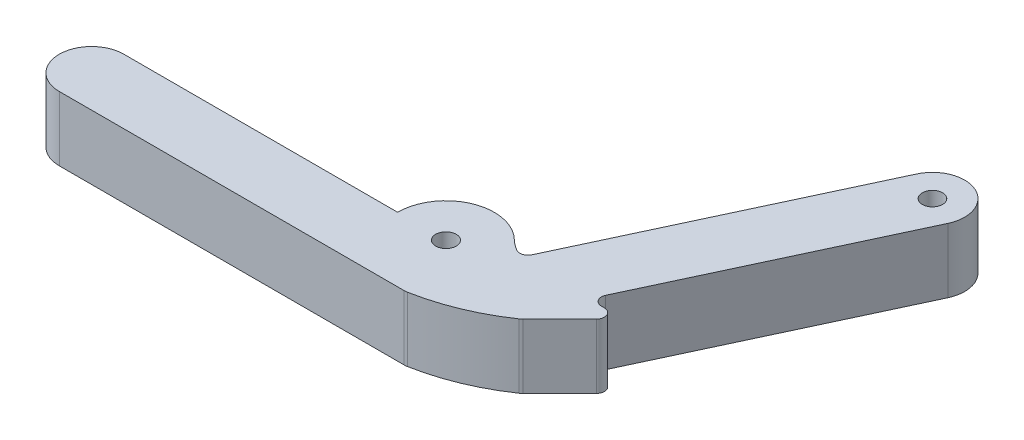
ISO-10303-21;
HEADER;
FILE_DESCRIPTION(('STEP AP214'),'2;1');
FILE_NAME('part.step','',(''),(''),'','','');
FILE_SCHEMA(('AUTOMOTIVE_DESIGN { 1 0 10303 214 1 1 1 1 }'));
ENDSEC;
DATA;
#1=APPLICATION_CONTEXT('core data for automotive mechanical design processes');
#2=APPLICATION_PROTOCOL_DEFINITION('international standard','automotive_design',2000,#1);
#3=PRODUCT_CONTEXT('',#1,'mechanical');
#4=PRODUCT('Part','Part','',(#3));
#5=PRODUCT_RELATED_PRODUCT_CATEGORY('part','',(#4));
#6=PRODUCT_DEFINITION_FORMATION('','',#4);
#7=PRODUCT_DEFINITION_CONTEXT('part definition',#1,'design');
#8=PRODUCT_DEFINITION('design','',#6,#7);
#9=PRODUCT_DEFINITION_SHAPE('','',#8);
#10=(LENGTH_UNIT() NAMED_UNIT(*) SI_UNIT(.MILLI.,.METRE.));
#11=(NAMED_UNIT(*) PLANE_ANGLE_UNIT() SI_UNIT($,.RADIAN.));
#12=(NAMED_UNIT(*) SI_UNIT($,.STERADIAN.) SOLID_ANGLE_UNIT());
#13=UNCERTAINTY_MEASURE_WITH_UNIT(LENGTH_MEASURE(1.E-05),#10,'distance_accuracy_value','');
#14=(GEOMETRIC_REPRESENTATION_CONTEXT(3) GLOBAL_UNCERTAINTY_ASSIGNED_CONTEXT((#13)) GLOBAL_UNIT_ASSIGNED_CONTEXT((#10,
#11,#12)) REPRESENTATION_CONTEXT('',''));
#15=CARTESIAN_POINT('',(0.,0.,0.));
#16=DIRECTION('',(0.,0.,1.));
#17=DIRECTION('',(1.,0.,0.));
#18=AXIS2_PLACEMENT_3D('',#15,#16,#17);
#19=CARTESIAN_POINT('',(-72.8411258837622,25.4,-62.4234738956629));
#20=DIRECTION('',(0.,1.,0.));
#21=DIRECTION('',(0.,0.,1.));
#22=AXIS2_PLACEMENT_3D('',#19,#20,#21);
#23=PLANE('',#22);
#24=CARTESIAN_POINT('',(54.1588741162378,25.4,-75.150873895024));
#25=DIRECTION('',(0.,1.,0.));
#26=DIRECTION('',(0.,0.,1.));
#27=AXIS2_PLACEMENT_3D('',#24,#25,#26);
#28=CIRCLE('',#27,4.05);
#29=CARTESIAN_POINT('',(54.1588741162378,25.4,-71.100873895024));
#30=VERTEX_POINT('',#29);
#31=EDGE_CURVE('E223',#30,#30,#28,.T.);
#32=ORIENTED_EDGE('',*,*,#31,.F.);
#33=EDGE_LOOP('',(#32));
#34=FACE_BOUND('',#33,.T.);
#35=CARTESIAN_POINT('',(-72.8411258837622,25.4,-62.4234738956629));
#36=DIRECTION('',(0.,1.,0.));
#37=DIRECTION('',(0.,0.,1.));
#38=AXIS2_PLACEMENT_3D('',#35,#36,#37);
#39=CIRCLE('',#38,12.7273999993611);
#40=CARTESIAN_POINT('',(-72.8411258837622,25.4,-75.150873895024));
#41=VERTEX_POINT('',#40);
#42=CARTESIAN_POINT('',(-72.8411258837622,25.4,-49.6960738963018));
#43=VERTEX_POINT('',#42);
#44=EDGE_CURVE('E265',#41,#43,#39,.T.);
#45=ORIENTED_EDGE('',*,*,#44,.T.);
#46=DIRECTION('',(1.,0.,0.));
#47=VECTOR('',#46,1.);
#48=CARTESIAN_POINT('',(-72.8411258837622,25.4,-49.6960738963018));
#49=LINE('',#48,#47);
#50=CARTESIAN_POINT('',(63.1581007165939,25.4,-49.6960738963018));
#51=VERTEX_POINT('',#50);
#52=EDGE_CURVE('E143',#43,#51,#49,.T.);
#53=ORIENTED_EDGE('',*,*,#52,.T.);
#54=CARTESIAN_POINT('',(63.1581007165939,25.4,-56.0460738963018));
#55=DIRECTION('',(0.,1.,0.));
#56=DIRECTION('',(0.,0.,-1.));
#57=AXIS2_PLACEMENT_3D('',#54,#55,#56);
#58=CIRCLE('',#57,6.34999999999999);
#59=CARTESIAN_POINT('',(64.3217055284206,25.4,-49.8035965161351));
#60=VERTEX_POINT('',#59);
#61=EDGE_CURVE('E318',#51,#60,#58,.T.);
#62=ORIENTED_EDGE('',*,*,#61,.T.);
#63=CARTESIAN_POINT('',(49.4142195386285,25.4,-129.778896670098));
#64=DIRECTION('',(0.,1.,0.));
#65=DIRECTION('',(0.,0.,1.));
#66=AXIS2_PLACEMENT_3D('',#63,#64,#65);
#67=CIRCLE('',#66,81.3528227737205);
#68=CARTESIAN_POINT('',(95.4241121689545,25.4,-62.6866351685046));
#69=VERTEX_POINT('',#68);
#70=EDGE_CURVE('E338',#60,#69,#67,.T.);
#71=ORIENTED_EDGE('',*,*,#70,.T.);
#72=CARTESIAN_POINT('',(91.8328069352663,25.4,-67.9235261086029));
#73=DIRECTION('',(0.,1.,0.));
#74=DIRECTION('',(0.,0.,1.));
#75=AXIS2_PLACEMENT_3D('',#72,#73,#74);
#76=CIRCLE('',#75,6.34999999999998);
#77=CARTESIAN_POINT('',(96.3229349958008,25.4,-63.4333980480683));
#78=VERTEX_POINT('',#77);
#79=EDGE_CURVE('E334',#69,#78,#76,.T.);
#80=ORIENTED_EDGE('',*,*,#79,.T.);
#81=DIRECTION('',(0.707106781186547,0.,-0.707106781186548));
#82=VECTOR('',#81,1.);
#83=CARTESIAN_POINT('',(110.746065504384,25.4,-77.856528556651));
#84=LINE('',#83,#82);
#85=CARTESIAN_POINT('',(110.746065504384,25.4,-77.856528556651));
#86=VERTEX_POINT('',#85);
#87=EDGE_CURVE('E337',#78,#86,#84,.T.);
#88=ORIENTED_EDGE('',*,*,#87,.T.);
#89=CARTESIAN_POINT('',(108.501001474116,25.4,-80.1015925869183));
#90=DIRECTION('',(0.,1.,0.));
#91=DIRECTION('',(0.,0.,-1.));
#92=AXIS2_PLACEMENT_3D('',#89,#90,#91);
#93=CIRCLE('',#92,3.175);
#94=CARTESIAN_POINT('',(108.501001474116,25.4,-83.2765925869183));
#95=VERTEX_POINT('',#94);
#96=EDGE_CURVE('E342',#86,#95,#93,.T.);
#97=ORIENTED_EDGE('',*,*,#96,.T.);
#98=DIRECTION('',(-1.,0.,0.));
#99=VECTOR('',#98,1.);
#100=CARTESIAN_POINT('',(107.323802413362,25.4,-83.2765925869183));
#101=LINE('',#100,#99);
#102=CARTESIAN_POINT('',(107.323802413362,25.4,-83.2765925869183));
#103=VERTEX_POINT('',#102);
#104=EDGE_CURVE('E349',#95,#103,#101,.T.);
#105=ORIENTED_EDGE('',*,*,#104,.T.);
#106=CARTESIAN_POINT('',(107.323802413362,25.4,-86.4515925869183));
#107=DIRECTION('',(0.,-1.,0.));
#108=DIRECTION('',(0.,0.,-1.));
#109=AXIS2_PLACEMENT_3D('',#106,#107,#108);
#110=CIRCLE('',#109,3.175);
#111=CARTESIAN_POINT('',(104.446275189521,25.4,-87.7934055679451));
#112=VERTEX_POINT('',#111);
#113=EDGE_CURVE('E352',#103,#112,#110,.T.);
#114=ORIENTED_EDGE('',*,*,#113,.T.);
#115=DIRECTION('',(0.422618261740704,0.,-0.906307787036648));
#116=VECTOR('',#115,1.);
#117=CARTESIAN_POINT('',(147.384290582376,25.4,-179.874276730869));
#118=LINE('',#117,#116);
#119=CARTESIAN_POINT('',(147.384290582376,25.4,-179.874276730869));
#120=VERTEX_POINT('',#119);
#121=EDGE_CURVE('E355',#112,#120,#118,.T.);
#122=ORIENTED_EDGE('',*,*,#121,.T.);
#123=CARTESIAN_POINT('',(135.874181686926,25.4,-185.241528655015));
#124=DIRECTION('',(0.,1.,0.));
#125=DIRECTION('',(0.,0.,1.));
#126=AXIS2_PLACEMENT_3D('',#123,#124,#125);
#127=CIRCLE('',#126,12.7000000000939);
#128=CARTESIAN_POINT('',(124.364072791475,25.4,-190.608780579162));
#129=VERTEX_POINT('',#128);
#130=EDGE_CURVE('E358',#120,#129,#127,.T.);
#131=ORIENTED_EDGE('',*,*,#130,.T.);
#132=DIRECTION('',(-0.422618261741958,0.,0.906307787036063));
#133=VECTOR('',#132,1.);
#134=CARTESIAN_POINT('',(124.364072791475,25.4,-190.608780579162));
#135=LINE('',#134,#133);
#136=CARTESIAN_POINT('',(76.0901584782388,25.4,-87.0850372547158));
#137=VERTEX_POINT('',#136);
#138=EDGE_CURVE('E361',#129,#137,#135,.T.);
#139=ORIENTED_EDGE('',*,*,#138,.T.);
#140=CARTESIAN_POINT('',(73.2126312543993,25.4,-88.4268502357465));
#141=DIRECTION('',(0.,-1.,0.));
#142=DIRECTION('',(0.,0.,1.));
#143=AXIS2_PLACEMENT_3D('',#140,#141,#142);
#144=CIRCLE('',#143,3.175);
#145=CARTESIAN_POINT('',(71.6788413395669,25.4,-85.6469017655121));
#146=VERTEX_POINT('',#145);
#147=EDGE_CURVE('E196',#137,#146,#144,.T.);
#148=ORIENTED_EDGE('',*,*,#147,.T.);
#149=CARTESIAN_POINT('',(80.8815808285614,25.4,-102.326592586918));
#150=DIRECTION('',(0.,-1.,0.));
#151=DIRECTION('',(0.,0.,1.));
#152=AXIS2_PLACEMENT_3D('',#149,#150,#151);
#153=CIRCLE('',#152,19.05);
#154=CARTESIAN_POINT('',(67.5248859229376,25.4,-88.7434706630716));
#155=VERTEX_POINT('',#154);
#156=EDGE_CURVE('E190',#146,#155,#153,.T.);
#157=ORIENTED_EDGE('',*,*,#156,.T.);
#158=CARTESIAN_POINT('',(54.1588741162378,25.4,-75.150873895024));
#159=DIRECTION('',(0.,1.,0.));
#160=DIRECTION('',(0.,0.,1.));
#161=AXIS2_PLACEMENT_3D('',#158,#159,#160);
#162=CIRCLE('',#161,19.0632882398493);
#163=CARTESIAN_POINT('',(35.0955858763885,25.4,-75.150873895024));
#164=VERTEX_POINT('',#163);
#165=EDGE_CURVE('E194',#155,#164,#162,.T.);
#166=ORIENTED_EDGE('',*,*,#165,.T.);
#167=DIRECTION('',(-1.,0.,0.));
#168=VECTOR('',#167,1.);
#169=CARTESIAN_POINT('',(35.0955858763885,25.4,-75.150873895024));
#170=LINE('',#169,#168);
#171=EDGE_CURVE('E64',#164,#41,#170,.T.);
#172=ORIENTED_EDGE('',*,*,#171,.T.);
#173=EDGE_LOOP('',(#45,#53,#62,#71,#80,#88,#97,#105,#114,#122,#131,#139,#148,#157,#166,#172));
#174=FACE_BOUND('',#173,.T.);
#175=CARTESIAN_POINT('',(135.874181686926,25.4,-185.241528655015));
#176=DIRECTION('',(0.,1.,0.));
#177=DIRECTION('',(0.,0.,1.));
#178=AXIS2_PLACEMENT_3D('',#175,#176,#177);
#179=CIRCLE('',#178,4.00000000008938);
#180=CARTESIAN_POINT('',(135.874181686926,25.4,-181.241528654926));
#181=VERTEX_POINT('',#180);
#182=EDGE_CURVE('E405',#181,#181,#179,.T.);
#183=ORIENTED_EDGE('',*,*,#182,.F.);
#184=EDGE_LOOP('',(#183));
#185=FACE_BOUND('',#184,.T.);
#186=ADVANCED_FACE('F43',(#34,#174,#185),#23,.T.);
#187=CARTESIAN_POINT('',(-72.8411258837622,0.,-62.4234738956629));
#188=DIRECTION('',(0.,1.,0.));
#189=DIRECTION('',(0.,0.,1.));
#190=AXIS2_PLACEMENT_3D('',#187,#188,#189);
#191=PLANE('',#190);
#192=CARTESIAN_POINT('',(-72.8411258837622,0.,-62.4234738956629));
#193=DIRECTION('',(0.,1.,0.));
#194=DIRECTION('',(0.,0.,1.));
#195=AXIS2_PLACEMENT_3D('',#192,#193,#194);
#196=CIRCLE('',#195,12.7273999993611);
#197=CARTESIAN_POINT('',(-72.8411258837622,0.,-75.150873895024));
#198=VERTEX_POINT('',#197);
#199=CARTESIAN_POINT('',(-72.8411258837622,0.,-49.6960738963018));
#200=VERTEX_POINT('',#199);
#201=EDGE_CURVE('E218',#198,#200,#196,.T.);
#202=ORIENTED_EDGE('',*,*,#201,.F.);
#203=DIRECTION('',(-1.,0.,0.));
#204=VECTOR('',#203,1.);
#205=CARTESIAN_POINT('',(35.0955858763885,0.,-75.150873895024));
#206=LINE('',#205,#204);
#207=CARTESIAN_POINT('',(35.0955858763885,0.,-75.150873895024));
#208=VERTEX_POINT('',#207);
#209=EDGE_CURVE('E134',#208,#198,#206,.T.);
#210=ORIENTED_EDGE('',*,*,#209,.F.);
#211=CARTESIAN_POINT('',(54.1588741162378,0.,-75.150873895024));
#212=DIRECTION('',(0.,1.,0.));
#213=DIRECTION('',(0.,0.,1.));
#214=AXIS2_PLACEMENT_3D('',#211,#212,#213);
#215=CIRCLE('',#214,19.0632882398493);
#216=CARTESIAN_POINT('',(67.5248859229376,0.,-88.7434706630716));
#217=VERTEX_POINT('',#216);
#218=EDGE_CURVE('E128',#217,#208,#215,.T.);
#219=ORIENTED_EDGE('',*,*,#218,.F.);
#220=CARTESIAN_POINT('',(80.8815808285614,0.,-102.326592586918));
#221=DIRECTION('',(0.,-1.,0.));
#222=DIRECTION('',(0.,0.,1.));
#223=AXIS2_PLACEMENT_3D('',#220,#221,#222);
#224=CIRCLE('',#223,19.05);
#225=CARTESIAN_POINT('',(71.6788413395669,0.,-85.6469017655121));
#226=VERTEX_POINT('',#225);
#227=EDGE_CURVE('E205',#226,#217,#224,.T.);
#228=ORIENTED_EDGE('',*,*,#227,.F.);
#229=CARTESIAN_POINT('',(73.2126312543993,0.,-88.4268502357465));
#230=DIRECTION('',(0.,-1.,0.));
#231=DIRECTION('',(0.,0.,1.));
#232=AXIS2_PLACEMENT_3D('',#229,#230,#231);
#233=CIRCLE('',#232,3.175);
#234=CARTESIAN_POINT('',(76.0901584782388,0.,-87.0850372547158));
#235=VERTEX_POINT('',#234);
#236=EDGE_CURVE('E256',#235,#226,#233,.T.);
#237=ORIENTED_EDGE('',*,*,#236,.F.);
#238=DIRECTION('',(-0.422618261741958,0.,0.906307787036063));
#239=VECTOR('',#238,1.);
#240=CARTESIAN_POINT('',(124.364072791475,0.,-190.608780579162));
#241=LINE('',#240,#239);
#242=CARTESIAN_POINT('',(124.364072791475,0.,-190.608780579162));
#243=VERTEX_POINT('',#242);
#244=EDGE_CURVE('E253',#243,#235,#241,.T.);
#245=ORIENTED_EDGE('',*,*,#244,.F.);
#246=CARTESIAN_POINT('',(135.874181686926,0.,-185.241528655015));
#247=DIRECTION('',(0.,1.,0.));
#248=DIRECTION('',(0.,0.,1.));
#249=AXIS2_PLACEMENT_3D('',#246,#247,#248);
#250=CIRCLE('',#249,12.7000000000939);
#251=CARTESIAN_POINT('',(147.384290582376,0.,-179.874276730869));
#252=VERTEX_POINT('',#251);
#253=EDGE_CURVE('E250',#252,#243,#250,.T.);
#254=ORIENTED_EDGE('',*,*,#253,.F.);
#255=DIRECTION('',(0.422618261740704,0.,-0.906307787036648));
#256=VECTOR('',#255,1.);
#257=CARTESIAN_POINT('',(147.384290582376,0.,-179.874276730869));
#258=LINE('',#257,#256);
#259=CARTESIAN_POINT('',(104.446275189521,0.,-87.7934055679451));
#260=VERTEX_POINT('',#259);
#261=EDGE_CURVE('E247',#260,#252,#258,.T.);
#262=ORIENTED_EDGE('',*,*,#261,.F.);
#263=CARTESIAN_POINT('',(107.323802413362,0.,-86.4515925869183));
#264=DIRECTION('',(0.,-1.,0.));
#265=DIRECTION('',(0.,0.,-1.));
#266=AXIS2_PLACEMENT_3D('',#263,#264,#265);
#267=CIRCLE('',#266,3.175);
#268=CARTESIAN_POINT('',(107.323802413362,0.,-83.2765925869183));
#269=VERTEX_POINT('',#268);
#270=EDGE_CURVE('E244',#269,#260,#267,.T.);
#271=ORIENTED_EDGE('',*,*,#270,.F.);
#272=DIRECTION('',(-1.,0.,0.));
#273=VECTOR('',#272,1.);
#274=CARTESIAN_POINT('',(107.323802413362,0.,-83.2765925869183));
#275=LINE('',#274,#273);
#276=CARTESIAN_POINT('',(108.501001474116,0.,-83.2765925869183));
#277=VERTEX_POINT('',#276);
#278=EDGE_CURVE('E241',#277,#269,#275,.T.);
#279=ORIENTED_EDGE('',*,*,#278,.F.);
#280=CARTESIAN_POINT('',(108.501001474116,0.,-80.1015925869183));
#281=DIRECTION('',(0.,1.,0.));
#282=DIRECTION('',(0.,0.,-1.));
#283=AXIS2_PLACEMENT_3D('',#280,#281,#282);
#284=CIRCLE('',#283,3.175);
#285=CARTESIAN_POINT('',(110.746065504384,0.,-77.856528556651));
#286=VERTEX_POINT('',#285);
#287=EDGE_CURVE('E238',#286,#277,#284,.T.);
#288=ORIENTED_EDGE('',*,*,#287,.F.);
#289=DIRECTION('',(0.707106781186547,0.,-0.707106781186548));
#290=VECTOR('',#289,1.);
#291=CARTESIAN_POINT('',(110.746065504384,0.,-77.856528556651));
#292=LINE('',#291,#290);
#293=CARTESIAN_POINT('',(96.3229349958008,0.,-63.4333980480683));
#294=VERTEX_POINT('',#293);
#295=EDGE_CURVE('E235',#294,#286,#292,.T.);
#296=ORIENTED_EDGE('',*,*,#295,.F.);
#297=CARTESIAN_POINT('',(91.8328069352663,0.,-67.9235261086029));
#298=DIRECTION('',(0.,1.,0.));
#299=DIRECTION('',(0.,0.,1.));
#300=AXIS2_PLACEMENT_3D('',#297,#298,#299);
#301=CIRCLE('',#300,6.34999999999998);
#302=CARTESIAN_POINT('',(95.4241121689545,0.,-62.6866351685046));
#303=VERTEX_POINT('',#302);
#304=EDGE_CURVE('E232',#303,#294,#301,.T.);
#305=ORIENTED_EDGE('',*,*,#304,.F.);
#306=CARTESIAN_POINT('',(49.4142195386285,0.,-129.778896670098));
#307=DIRECTION('',(0.,1.,0.));
#308=DIRECTION('',(0.,0.,1.));
#309=AXIS2_PLACEMENT_3D('',#306,#307,#308);
#310=CIRCLE('',#309,81.3528227737205);
#311=CARTESIAN_POINT('',(64.3217055284206,0.,-49.8035965161351));
#312=VERTEX_POINT('',#311);
#313=EDGE_CURVE('E229',#312,#303,#310,.T.);
#314=ORIENTED_EDGE('',*,*,#313,.F.);
#315=CARTESIAN_POINT('',(63.1581007165939,0.,-56.0460738963018));
#316=DIRECTION('',(0.,1.,0.));
#317=DIRECTION('',(0.,0.,-1.));
#318=AXIS2_PLACEMENT_3D('',#315,#316,#317);
#319=CIRCLE('',#318,6.34999999999999);
#320=CARTESIAN_POINT('',(63.1581007165939,0.,-49.6960738963018));
#321=VERTEX_POINT('',#320);
#322=EDGE_CURVE('E226',#321,#312,#319,.T.);
#323=ORIENTED_EDGE('',*,*,#322,.F.);
#324=DIRECTION('',(1.,0.,0.));
#325=VECTOR('',#324,1.);
#326=CARTESIAN_POINT('',(38.2705858763885,0.,-49.6960738963018));
#327=LINE('',#326,#325);
#328=EDGE_CURVE('E222',#200,#321,#327,.T.);
#329=ORIENTED_EDGE('',*,*,#328,.F.);
#330=EDGE_LOOP('',(#202,#210,#219,#228,#237,#245,#254,#262,#271,#279,#288,#296,#305,#314,#323,#329));
#331=FACE_BOUND('',#330,.T.);
#332=CARTESIAN_POINT('',(54.1588741162378,0.,-75.150873895024));
#333=DIRECTION('',(0.,1.,0.));
#334=DIRECTION('',(0.,0.,1.));
#335=AXIS2_PLACEMENT_3D('',#332,#333,#334);
#336=CIRCLE('',#335,4.05);
#337=CARTESIAN_POINT('',(54.1588741162378,0.,-71.100873895024));
#338=VERTEX_POINT('',#337);
#339=EDGE_CURVE('E413',#338,#338,#336,.T.);
#340=ORIENTED_EDGE('',*,*,#339,.T.);
#341=EDGE_LOOP('',(#340));
#342=FACE_BOUND('',#341,.T.);
#343=CARTESIAN_POINT('',(135.874181686926,0.,-185.241528655015));
#344=DIRECTION('',(0.,1.,0.));
#345=DIRECTION('',(0.,0.,1.));
#346=AXIS2_PLACEMENT_3D('',#343,#344,#345);
#347=CIRCLE('',#346,4.00000000008938);
#348=CARTESIAN_POINT('',(135.874181686926,0.,-181.241528654926));
#349=VERTEX_POINT('',#348);
#350=EDGE_CURVE('E408',#349,#349,#347,.T.);
#351=ORIENTED_EDGE('',*,*,#350,.T.);
#352=EDGE_LOOP('',(#351));
#353=FACE_BOUND('',#352,.T.);
#354=ADVANCED_FACE('F322',(#331,#342,#353),#191,.F.);
#355=CARTESIAN_POINT('',(-72.8411258837622,25.4,-62.4234738956629));
#356=DIRECTION('',(0.,-1.,0.));
#357=DIRECTION('',(0.,0.,-1.));
#358=AXIS2_PLACEMENT_3D('',#355,#356,#357);
#359=CYLINDRICAL_SURFACE('',#358,12.7273999993611);
#360=ORIENTED_EDGE('',*,*,#201,.T.);
#361=DIRECTION('',(0.,-1.,0.));
#362=VECTOR('',#361,1.);
#363=CARTESIAN_POINT('',(-72.8411258837622,25.4,-49.6960738963018));
#364=LINE('',#363,#362);
#365=EDGE_CURVE('E11',#43,#200,#364,.T.);
#366=ORIENTED_EDGE('',*,*,#365,.F.);
#367=ORIENTED_EDGE('',*,*,#44,.F.);
#368=DIRECTION('',(0.,-1.,0.));
#369=VECTOR('',#368,1.);
#370=CARTESIAN_POINT('',(-72.8411258837622,25.4,-75.150873895024));
#371=LINE('',#370,#369);
#372=EDGE_CURVE('E214',#41,#198,#371,.T.);
#373=ORIENTED_EDGE('',*,*,#372,.T.);
#374=EDGE_LOOP('',(#360,#366,#367,#373));
#375=FACE_BOUND('',#374,.T.);
#376=ADVANCED_FACE('F45',(#375),#359,.T.);
#377=CARTESIAN_POINT('',(38.2705858763885,25.4,-49.6960738963018));
#378=DIRECTION('',(0.,0.,-1.));
#379=DIRECTION('',(-1.,0.,0.));
#380=AXIS2_PLACEMENT_3D('',#377,#378,#379);
#381=PLANE('',#380);
#382=ORIENTED_EDGE('',*,*,#328,.T.);
#383=DIRECTION('',(0.,-1.,0.));
#384=VECTOR('',#383,1.);
#385=CARTESIAN_POINT('',(63.1581007165939,25.4,-49.6960738963018));
#386=LINE('',#385,#384);
#387=EDGE_CURVE('E53',#51,#321,#386,.T.);
#388=ORIENTED_EDGE('',*,*,#387,.F.);
#389=ORIENTED_EDGE('',*,*,#52,.F.);
#390=ORIENTED_EDGE('',*,*,#365,.T.);
#391=EDGE_LOOP('',(#382,#388,#389,#390));
#392=FACE_BOUND('',#391,.T.);
#393=ADVANCED_FACE('F496',(#392),#381,.F.);
#394=CARTESIAN_POINT('',(63.1581007165939,25.4,-56.0460738963018));
#395=DIRECTION('',(0.,-1.,0.));
#396=DIRECTION('',(0.,0.,-1.));
#397=AXIS2_PLACEMENT_3D('',#394,#395,#396);
#398=CYLINDRICAL_SURFACE('',#397,6.34999999999999);
#399=ORIENTED_EDGE('',*,*,#322,.T.);
#400=DIRECTION('',(0.,-1.,0.));
#401=VECTOR('',#400,1.);
#402=CARTESIAN_POINT('',(64.3217055284206,25.4,-49.8035965161351));
#403=LINE('',#402,#401);
#404=EDGE_CURVE('E308',#60,#312,#403,.T.);
#405=ORIENTED_EDGE('',*,*,#404,.F.);
#406=ORIENTED_EDGE('',*,*,#61,.F.);
#407=ORIENTED_EDGE('',*,*,#387,.T.);
#408=EDGE_LOOP('',(#399,#405,#406,#407));
#409=FACE_BOUND('',#408,.T.);
#410=ADVANCED_FACE('F316',(#409),#398,.T.);
#411=CARTESIAN_POINT('',(49.4142195386285,25.4,-129.778896670098));
#412=DIRECTION('',(0.,-1.,0.));
#413=DIRECTION('',(0.,0.,-1.));
#414=AXIS2_PLACEMENT_3D('',#411,#412,#413);
#415=CYLINDRICAL_SURFACE('',#414,81.3528227737205);
#416=ORIENTED_EDGE('',*,*,#313,.T.);
#417=DIRECTION('',(0.,-1.,0.));
#418=VECTOR('',#417,1.);
#419=CARTESIAN_POINT('',(95.4241121689545,25.4,-62.6866351685046));
#420=LINE('',#419,#418);
#421=EDGE_CURVE('E304',#69,#303,#420,.T.);
#422=ORIENTED_EDGE('',*,*,#421,.F.);
#423=ORIENTED_EDGE('',*,*,#70,.F.);
#424=ORIENTED_EDGE('',*,*,#404,.T.);
#425=EDGE_LOOP('',(#416,#422,#423,#424));
#426=FACE_BOUND('',#425,.T.);
#427=ADVANCED_FACE('F328',(#426),#415,.T.);
#428=CARTESIAN_POINT('',(91.8328069352663,25.4,-67.9235261086029));
#429=DIRECTION('',(0.,-1.,0.));
#430=DIRECTION('',(0.,0.,-1.));
#431=AXIS2_PLACEMENT_3D('',#428,#429,#430);
#432=CYLINDRICAL_SURFACE('',#431,6.34999999999998);
#433=ORIENTED_EDGE('',*,*,#304,.T.);
#434=DIRECTION('',(0.,-1.,0.));
#435=VECTOR('',#434,1.);
#436=CARTESIAN_POINT('',(96.3229349958008,25.4,-63.4333980480683));
#437=LINE('',#436,#435);
#438=EDGE_CURVE('E300',#78,#294,#437,.T.);
#439=ORIENTED_EDGE('',*,*,#438,.F.);
#440=ORIENTED_EDGE('',*,*,#79,.F.);
#441=ORIENTED_EDGE('',*,*,#421,.T.);
#442=EDGE_LOOP('',(#433,#439,#440,#441));
#443=FACE_BOUND('',#442,.T.);
#444=ADVANCED_FACE('F332',(#443),#432,.T.);
#445=CARTESIAN_POINT('',(110.746065504384,25.4,-77.856528556651));
#446=DIRECTION('',(-0.707106781186548,0.,-0.707106781186547));
#447=DIRECTION('',(-0.707106781186547,0.,0.707106781186548));
#448=AXIS2_PLACEMENT_3D('',#445,#446,#447);
#449=PLANE('',#448);
#450=ORIENTED_EDGE('',*,*,#295,.T.);
#451=DIRECTION('',(0.,-1.,0.));
#452=VECTOR('',#451,1.);
#453=CARTESIAN_POINT('',(110.746065504384,25.4,-77.856528556651));
#454=LINE('',#453,#452);
#455=EDGE_CURVE('E296',#86,#286,#454,.T.);
#456=ORIENTED_EDGE('',*,*,#455,.F.);
#457=ORIENTED_EDGE('',*,*,#87,.F.);
#458=ORIENTED_EDGE('',*,*,#438,.T.);
#459=EDGE_LOOP('',(#450,#456,#457,#458));
#460=FACE_BOUND('',#459,.T.);
#461=ADVANCED_FACE('F453',(#460),#449,.F.);
#462=CARTESIAN_POINT('',(108.501001474116,25.4,-80.1015925869183));
#463=DIRECTION('',(0.,-1.,0.));
#464=DIRECTION('',(0.,0.,-1.));
#465=AXIS2_PLACEMENT_3D('',#462,#463,#464);
#466=CYLINDRICAL_SURFACE('',#465,3.175);
#467=ORIENTED_EDGE('',*,*,#287,.T.);
#468=DIRECTION('',(0.,-1.,0.));
#469=VECTOR('',#468,1.);
#470=CARTESIAN_POINT('',(108.501001474116,25.4,-83.2765925869183));
#471=LINE('',#470,#469);
#472=EDGE_CURVE('E292',#95,#277,#471,.T.);
#473=ORIENTED_EDGE('',*,*,#472,.F.);
#474=ORIENTED_EDGE('',*,*,#96,.F.);
#475=ORIENTED_EDGE('',*,*,#455,.T.);
#476=EDGE_LOOP('',(#467,#473,#474,#475));
#477=FACE_BOUND('',#476,.T.);
#478=ADVANCED_FACE('F448',(#477),#466,.T.);
#479=CARTESIAN_POINT('',(107.323802413362,25.4,-83.2765925869183));
#480=DIRECTION('',(0.,0.,1.));
#481=DIRECTION('',(1.,0.,0.));
#482=AXIS2_PLACEMENT_3D('',#479,#480,#481);
#483=PLANE('',#482);
#484=ORIENTED_EDGE('',*,*,#278,.T.);
#485=DIRECTION('',(0.,-1.,0.));
#486=VECTOR('',#485,1.);
#487=CARTESIAN_POINT('',(107.323802413362,25.4,-83.2765925869183));
#488=LINE('',#487,#486);
#489=EDGE_CURVE('E288',#103,#269,#488,.T.);
#490=ORIENTED_EDGE('',*,*,#489,.F.);
#491=ORIENTED_EDGE('',*,*,#104,.F.);
#492=ORIENTED_EDGE('',*,*,#472,.T.);
#493=EDGE_LOOP('',(#484,#490,#491,#492));
#494=FACE_BOUND('',#493,.T.);
#495=ADVANCED_FACE('F452',(#494),#483,.F.);
#496=CARTESIAN_POINT('',(107.323802413362,25.4,-86.4515925869183));
#497=DIRECTION('',(0.,-1.,0.));
#498=DIRECTION('',(0.,0.,-1.));
#499=AXIS2_PLACEMENT_3D('',#496,#497,#498);
#500=CYLINDRICAL_SURFACE('',#499,3.175);
#501=ORIENTED_EDGE('',*,*,#270,.T.);
#502=DIRECTION('',(0.,-1.,0.));
#503=VECTOR('',#502,1.);
#504=CARTESIAN_POINT('',(104.446275189521,25.4,-87.7934055679451));
#505=LINE('',#504,#503);
#506=EDGE_CURVE('E284',#112,#260,#505,.T.);
#507=ORIENTED_EDGE('',*,*,#506,.F.);
#508=ORIENTED_EDGE('',*,*,#113,.F.);
#509=ORIENTED_EDGE('',*,*,#489,.T.);
#510=EDGE_LOOP('',(#501,#507,#508,#509));
#511=FACE_BOUND('',#510,.T.);
#512=ADVANCED_FACE('F468',(#511),#500,.F.);
#513=CARTESIAN_POINT('',(147.384290582376,25.4,-179.874276730869));
#514=DIRECTION('',(-0.906307787036648,0.,-0.422618261740704));
#515=DIRECTION('',(-0.422618261740704,0.,0.906307787036648));
#516=AXIS2_PLACEMENT_3D('',#513,#514,#515);
#517=PLANE('',#516);
#518=ORIENTED_EDGE('',*,*,#261,.T.);
#519=DIRECTION('',(0.,-1.,0.));
#520=VECTOR('',#519,1.);
#521=CARTESIAN_POINT('',(147.384290582376,25.4,-179.874276730869));
#522=LINE('',#521,#520);
#523=EDGE_CURVE('E280',#120,#252,#522,.T.);
#524=ORIENTED_EDGE('',*,*,#523,.F.);
#525=ORIENTED_EDGE('',*,*,#121,.F.);
#526=ORIENTED_EDGE('',*,*,#506,.T.);
#527=EDGE_LOOP('',(#518,#524,#525,#526));
#528=FACE_BOUND('',#527,.T.);
#529=ADVANCED_FACE('F463',(#528),#517,.F.);
#530=CARTESIAN_POINT('',(135.874181686926,25.4,-185.241528655015));
#531=DIRECTION('',(0.,-1.,0.));
#532=DIRECTION('',(0.,0.,-1.));
#533=AXIS2_PLACEMENT_3D('',#530,#531,#532);
#534=CYLINDRICAL_SURFACE('',#533,12.7000000000939);
#535=ORIENTED_EDGE('',*,*,#253,.T.);
#536=DIRECTION('',(0.,-1.,0.));
#537=VECTOR('',#536,1.);
#538=CARTESIAN_POINT('',(124.364072791475,25.4,-190.608780579162));
#539=LINE('',#538,#537);
#540=EDGE_CURVE('E276',#129,#243,#539,.T.);
#541=ORIENTED_EDGE('',*,*,#540,.F.);
#542=ORIENTED_EDGE('',*,*,#130,.F.);
#543=ORIENTED_EDGE('',*,*,#523,.T.);
#544=EDGE_LOOP('',(#535,#541,#542,#543));
#545=FACE_BOUND('',#544,.T.);
#546=ADVANCED_FACE('F467',(#545),#534,.T.);
#547=CARTESIAN_POINT('',(124.364072791475,25.4,-190.608780579162));
#548=DIRECTION('',(0.906307787036063,0.,0.422618261741958));
#549=DIRECTION('',(0.422618261741958,0.,-0.906307787036063));
#550=AXIS2_PLACEMENT_3D('',#547,#548,#549);
#551=PLANE('',#550);
#552=ORIENTED_EDGE('',*,*,#244,.T.);
#553=DIRECTION('',(0.,-1.,0.));
#554=VECTOR('',#553,1.);
#555=CARTESIAN_POINT('',(76.0901584782388,25.4,-87.0850372547158));
#556=LINE('',#555,#554);
#557=EDGE_CURVE('E272',#137,#235,#556,.T.);
#558=ORIENTED_EDGE('',*,*,#557,.F.);
#559=ORIENTED_EDGE('',*,*,#138,.F.);
#560=ORIENTED_EDGE('',*,*,#540,.T.);
#561=EDGE_LOOP('',(#552,#558,#559,#560));
#562=FACE_BOUND('',#561,.T.);
#563=ADVANCED_FACE('F369',(#562),#551,.F.);
#564=CARTESIAN_POINT('',(73.2126312543993,25.4,-88.4268502357465));
#565=DIRECTION('',(0.,-1.,0.));
#566=DIRECTION('',(0.,0.,-1.));
#567=AXIS2_PLACEMENT_3D('',#564,#565,#566);
#568=CYLINDRICAL_SURFACE('',#567,3.175);
#569=ORIENTED_EDGE('',*,*,#236,.T.);
#570=DIRECTION('',(0.,-1.,0.));
#571=VECTOR('',#570,1.);
#572=CARTESIAN_POINT('',(71.6788413395669,25.4,-85.6469017655121));
#573=LINE('',#572,#571);
#574=EDGE_CURVE('E207',#146,#226,#573,.T.);
#575=ORIENTED_EDGE('',*,*,#574,.F.);
#576=ORIENTED_EDGE('',*,*,#147,.F.);
#577=ORIENTED_EDGE('',*,*,#557,.T.);
#578=EDGE_LOOP('',(#569,#575,#576,#577));
#579=FACE_BOUND('',#578,.T.);
#580=ADVANCED_FACE('F373',(#579),#568,.F.);
#581=CARTESIAN_POINT('',(80.8815808285614,25.4,-102.326592586918));
#582=DIRECTION('',(0.,-1.,0.));
#583=DIRECTION('',(0.,0.,-1.));
#584=AXIS2_PLACEMENT_3D('',#581,#582,#583);
#585=CYLINDRICAL_SURFACE('',#584,19.05);
#586=ORIENTED_EDGE('',*,*,#227,.T.);
#587=DIRECTION('',(0.,-1.,0.));
#588=VECTOR('',#587,1.);
#589=CARTESIAN_POINT('',(67.5248859229376,25.4,-88.7434706630716));
#590=LINE('',#589,#588);
#591=EDGE_CURVE('E202',#155,#217,#590,.T.);
#592=ORIENTED_EDGE('',*,*,#591,.F.);
#593=ORIENTED_EDGE('',*,*,#156,.F.);
#594=ORIENTED_EDGE('',*,*,#574,.T.);
#595=EDGE_LOOP('',(#586,#592,#593,#594));
#596=FACE_BOUND('',#595,.T.);
#597=ADVANCED_FACE('F203',(#596),#585,.F.);
#598=CARTESIAN_POINT('',(54.1588741162378,25.4,-75.150873895024));
#599=DIRECTION('',(0.,-1.,0.));
#600=DIRECTION('',(0.,0.,-1.));
#601=AXIS2_PLACEMENT_3D('',#598,#599,#600);
#602=CYLINDRICAL_SURFACE('',#601,19.0632882398493);
#603=ORIENTED_EDGE('',*,*,#218,.T.);
#604=DIRECTION('',(0.,-1.,0.));
#605=VECTOR('',#604,1.);
#606=CARTESIAN_POINT('',(35.0955858763885,25.4,-75.150873895024));
#607=LINE('',#606,#605);
#608=EDGE_CURVE('E208',#164,#208,#607,.T.);
#609=ORIENTED_EDGE('',*,*,#608,.F.);
#610=ORIENTED_EDGE('',*,*,#165,.F.);
#611=ORIENTED_EDGE('',*,*,#591,.T.);
#612=EDGE_LOOP('',(#603,#609,#610,#611));
#613=FACE_BOUND('',#612,.T.);
#614=ADVANCED_FACE('F210',(#613),#602,.T.);
#615=CARTESIAN_POINT('',(35.0955858763885,25.4,-75.150873895024));
#616=DIRECTION('',(0.,0.,1.));
#617=DIRECTION('',(1.,0.,0.));
#618=AXIS2_PLACEMENT_3D('',#615,#616,#617);
#619=PLANE('',#618);
#620=ORIENTED_EDGE('',*,*,#209,.T.);
#621=ORIENTED_EDGE('',*,*,#372,.F.);
#622=ORIENTED_EDGE('',*,*,#171,.F.);
#623=ORIENTED_EDGE('',*,*,#608,.T.);
#624=EDGE_LOOP('',(#620,#621,#622,#623));
#625=FACE_BOUND('',#624,.T.);
#626=ADVANCED_FACE('F377',(#625),#619,.F.);
#627=CARTESIAN_POINT('',(54.1588741162378,25.4,-75.150873895024));
#628=DIRECTION('',(0.,-1.,0.));
#629=DIRECTION('',(0.,0.,-1.));
#630=AXIS2_PLACEMENT_3D('',#627,#628,#629);
#631=CYLINDRICAL_SURFACE('',#630,4.05);
#632=ORIENTED_EDGE('',*,*,#31,.T.);
#633=EDGE_LOOP('',(#632));
#634=FACE_BOUND('',#633,.T.);
#635=ORIENTED_EDGE('',*,*,#339,.F.);
#636=EDGE_LOOP('',(#635));
#637=FACE_BOUND('',#636,.T.);
#638=ADVANCED_FACE('F379',(#634,#637),#631,.F.);
#639=CARTESIAN_POINT('',(135.874181686926,25.4,-185.241528655015));
#640=DIRECTION('',(0.,-1.,0.));
#641=DIRECTION('',(0.,0.,-1.));
#642=AXIS2_PLACEMENT_3D('',#639,#640,#641);
#643=CYLINDRICAL_SURFACE('',#642,4.00000000008938);
#644=ORIENTED_EDGE('',*,*,#182,.T.);
#645=EDGE_LOOP('',(#644));
#646=FACE_BOUND('',#645,.T.);
#647=ORIENTED_EDGE('',*,*,#350,.F.);
#648=EDGE_LOOP('',(#647));
#649=FACE_BOUND('',#648,.T.);
#650=ADVANCED_FACE('F385',(#646,#649),#643,.F.);
#651=CLOSED_SHELL('',(#186,#354,#376,#393,#410,#427,#444,#461,#478,#495,#512,#529,#546,#563,
#580,#597,#614,#626,#638,#650));
#652=MANIFOLD_SOLID_BREP('B2',#651);
#653=ADVANCED_BREP_SHAPE_REPRESENTATION('',(#18,#652),#14);
#654=SHAPE_DEFINITION_REPRESENTATION(#9,#653);
ENDSEC;
END-ISO-10303-21;
